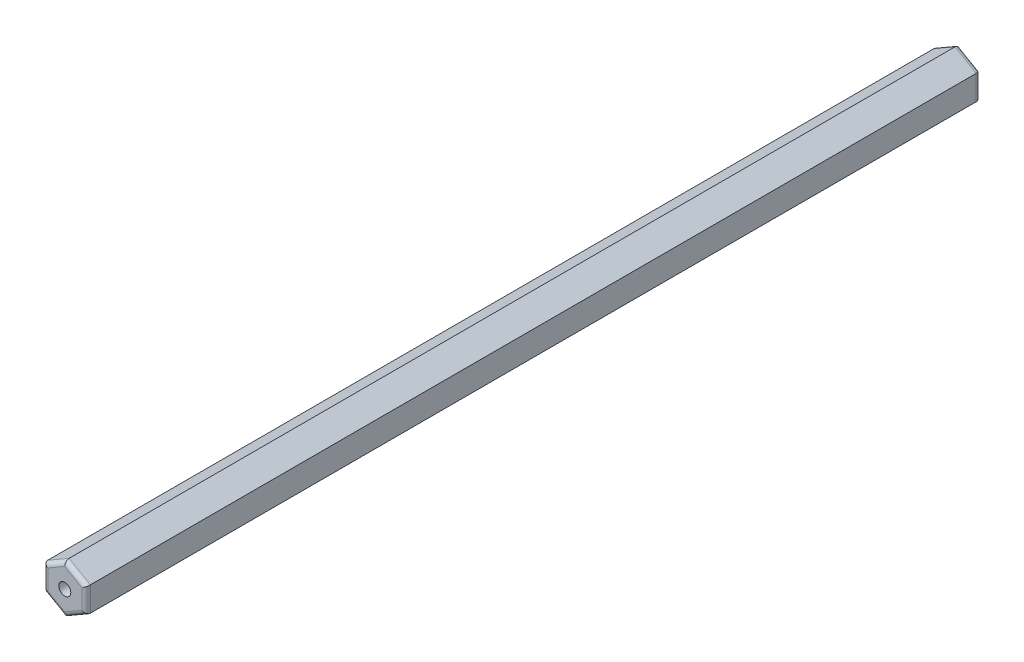
ISO-10303-21;
HEADER;
FILE_DESCRIPTION(('STEP AP214'),'2;1');
FILE_NAME('part.step','',(''),(''),'','','');
FILE_SCHEMA(('AUTOMOTIVE_DESIGN { 1 0 10303 214 1 1 1 1 }'));
ENDSEC;
DATA;
#1=APPLICATION_CONTEXT('core data for automotive mechanical design processes');
#2=APPLICATION_PROTOCOL_DEFINITION('international standard','automotive_design',2000,#1);
#3=PRODUCT_CONTEXT('',#1,'mechanical');
#4=PRODUCT('Part','Part','',(#3));
#5=PRODUCT_RELATED_PRODUCT_CATEGORY('part','',(#4));
#6=PRODUCT_DEFINITION_FORMATION('','',#4);
#7=PRODUCT_DEFINITION_CONTEXT('part definition',#1,'design');
#8=PRODUCT_DEFINITION('design','',#6,#7);
#9=PRODUCT_DEFINITION_SHAPE('','',#8);
#10=(LENGTH_UNIT() NAMED_UNIT(*) SI_UNIT(.MILLI.,.METRE.));
#11=(NAMED_UNIT(*) PLANE_ANGLE_UNIT() SI_UNIT($,.RADIAN.));
#12=(NAMED_UNIT(*) SI_UNIT($,.STERADIAN.) SOLID_ANGLE_UNIT());
#13=UNCERTAINTY_MEASURE_WITH_UNIT(LENGTH_MEASURE(1.E-05),#10,'distance_accuracy_value','');
#14=(GEOMETRIC_REPRESENTATION_CONTEXT(3) GLOBAL_UNCERTAINTY_ASSIGNED_CONTEXT((#13)) GLOBAL_UNIT_ASSIGNED_CONTEXT((#10,
#11,#12)) REPRESENTATION_CONTEXT('',''));
#15=CARTESIAN_POINT('',(0.,0.,0.));
#16=DIRECTION('',(0.,0.,1.));
#17=DIRECTION('',(1.,0.,0.));
#18=AXIS2_PLACEMENT_3D('',#15,#16,#17);
#19=CARTESIAN_POINT('',(-52.50212267549,1.44337567297407,30.));
#20=DIRECTION('',(0.5,0.866025403784439,0.));
#21=DIRECTION('',(-0.866025403784439,0.5,0.));
#22=AXIS2_PLACEMENT_3D('',#19,#20,#21);
#23=PLANE('',#22);
#24=DIRECTION('',(0.,0.,1.));
#25=VECTOR('',#24,1.);
#26=CARTESIAN_POINT('',(-55.00212267549,2.88675134594813,30.));
#27=LINE('',#26,#25);
#28=CARTESIAN_POINT('',(-55.00212267549,2.88675134594813,30.5));
#29=VERTEX_POINT('',#28);
#30=CARTESIAN_POINT('',(-55.00212267549,2.88675134594813,134.5));
#31=VERTEX_POINT('',#30);
#32=EDGE_CURVE('E152',#29,#31,#27,.T.);
#33=ORIENTED_EDGE('',*,*,#32,.T.);
#34=DIRECTION('',(-0.866025403784439,0.5,0.));
#35=VECTOR('',#34,1.);
#36=CARTESIAN_POINT('',(-52.50212267549,1.44337567297407,134.5));
#37=LINE('',#36,#35);
#38=CARTESIAN_POINT('',(-52.50212267549,1.44337567297407,134.5));
#39=VERTEX_POINT('',#38);
#40=EDGE_CURVE('E149',#31,#39,#37,.F.);
#41=ORIENTED_EDGE('',*,*,#40,.T.);
#42=DIRECTION('',(0.,0.,1.));
#43=VECTOR('',#42,1.);
#44=CARTESIAN_POINT('',(-52.50212267549,1.44337567297407,30.));
#45=LINE('',#44,#43);
#46=CARTESIAN_POINT('',(-52.50212267549,1.44337567297407,30.5));
#47=VERTEX_POINT('',#46);
#48=EDGE_CURVE('E146',#47,#39,#45,.T.);
#49=ORIENTED_EDGE('',*,*,#48,.F.);
#50=DIRECTION('',(-0.866025403784439,0.5,0.));
#51=VECTOR('',#50,1.);
#52=CARTESIAN_POINT('',(-55.00212267549,2.88675134594813,30.5));
#53=LINE('',#52,#51);
#54=EDGE_CURVE('E206',#47,#29,#53,.T.);
#55=ORIENTED_EDGE('',*,*,#54,.T.);
#56=EDGE_LOOP('',(#33,#41,#49,#55));
#57=FACE_BOUND('',#56,.T.);
#58=ADVANCED_FACE('F32',(#57),#23,.T.);
#59=CARTESIAN_POINT('',(-52.50212267549,-1.44337567297408,30.));
#60=DIRECTION('',(1.,0.,0.));
#61=DIRECTION('',(0.,0.,-1.));
#62=AXIS2_PLACEMENT_3D('',#59,#60,#61);
#63=PLANE('',#62);
#64=ORIENTED_EDGE('',*,*,#48,.T.);
#65=DIRECTION('',(0.,1.,0.));
#66=VECTOR('',#65,1.);
#67=CARTESIAN_POINT('',(-52.50212267549,-1.44337567297408,134.5));
#68=LINE('',#67,#66);
#69=CARTESIAN_POINT('',(-52.50212267549,-1.44337567297408,134.5));
#70=VERTEX_POINT('',#69);
#71=EDGE_CURVE('E191',#39,#70,#68,.F.);
#72=ORIENTED_EDGE('',*,*,#71,.T.);
#73=DIRECTION('',(0.,0.,1.));
#74=VECTOR('',#73,1.);
#75=CARTESIAN_POINT('',(-52.50212267549,-1.44337567297408,30.));
#76=LINE('',#75,#74);
#77=CARTESIAN_POINT('',(-52.50212267549,-1.44337567297408,30.5));
#78=VERTEX_POINT('',#77);
#79=EDGE_CURVE('E255',#78,#70,#76,.T.);
#80=ORIENTED_EDGE('',*,*,#79,.F.);
#81=DIRECTION('',(0.,1.,0.));
#82=VECTOR('',#81,1.);
#83=CARTESIAN_POINT('',(-52.50212267549,1.44337567297407,30.5));
#84=LINE('',#83,#82);
#85=EDGE_CURVE('E197',#78,#47,#84,.T.);
#86=ORIENTED_EDGE('',*,*,#85,.T.);
#87=EDGE_LOOP('',(#64,#72,#80,#86));
#88=FACE_BOUND('',#87,.T.);
#89=ADVANCED_FACE('F284',(#88),#63,.T.);
#90=CARTESIAN_POINT('',(-55.00212267549,-2.88675134594813,30.));
#91=DIRECTION('',(0.5,-0.866025403784439,0.));
#92=DIRECTION('',(0.866025403784439,0.5,0.));
#93=AXIS2_PLACEMENT_3D('',#90,#91,#92);
#94=PLANE('',#93);
#95=ORIENTED_EDGE('',*,*,#79,.T.);
#96=DIRECTION('',(0.866025403784439,0.5,0.));
#97=VECTOR('',#96,1.);
#98=CARTESIAN_POINT('',(-55.00212267549,-2.88675134594813,134.5));
#99=LINE('',#98,#97);
#100=CARTESIAN_POINT('',(-55.00212267549,-2.88675134594813,134.5));
#101=VERTEX_POINT('',#100);
#102=EDGE_CURVE('E231',#70,#101,#99,.F.);
#103=ORIENTED_EDGE('',*,*,#102,.T.);
#104=DIRECTION('',(0.,0.,1.));
#105=VECTOR('',#104,1.);
#106=CARTESIAN_POINT('',(-55.00212267549,-2.88675134594813,30.));
#107=LINE('',#106,#105);
#108=CARTESIAN_POINT('',(-55.00212267549,-2.88675134594813,30.5));
#109=VERTEX_POINT('',#108);
#110=EDGE_CURVE('E253',#109,#101,#107,.T.);
#111=ORIENTED_EDGE('',*,*,#110,.F.);
#112=DIRECTION('',(0.866025403784439,0.5,0.));
#113=VECTOR('',#112,1.);
#114=CARTESIAN_POINT('',(-52.50212267549,-1.44337567297408,30.5));
#115=LINE('',#114,#113);
#116=EDGE_CURVE('E234',#109,#78,#115,.T.);
#117=ORIENTED_EDGE('',*,*,#116,.T.);
#118=EDGE_LOOP('',(#95,#103,#111,#117));
#119=FACE_BOUND('',#118,.T.);
#120=ADVANCED_FACE('F290',(#119),#94,.T.);
#121=CARTESIAN_POINT('',(-57.50212267549,-1.44337567297406,30.));
#122=DIRECTION('',(-0.5,-0.866025403784438,0.));
#123=DIRECTION('',(0.866025403784438,-0.5,0.));
#124=AXIS2_PLACEMENT_3D('',#121,#122,#123);
#125=PLANE('',#124);
#126=ORIENTED_EDGE('',*,*,#110,.T.);
#127=DIRECTION('',(0.866025403784438,-0.5,0.));
#128=VECTOR('',#127,1.);
#129=CARTESIAN_POINT('',(-57.50212267549,-1.44337567297406,134.5));
#130=LINE('',#129,#128);
#131=CARTESIAN_POINT('',(-57.50212267549,-1.44337567297406,134.5));
#132=VERTEX_POINT('',#131);
#133=EDGE_CURVE('E201',#101,#132,#130,.F.);
#134=ORIENTED_EDGE('',*,*,#133,.T.);
#135=DIRECTION('',(0.,0.,1.));
#136=VECTOR('',#135,1.);
#137=CARTESIAN_POINT('',(-57.50212267549,-1.44337567297406,30.));
#138=LINE('',#137,#136);
#139=CARTESIAN_POINT('',(-57.50212267549,-1.44337567297406,30.5));
#140=VERTEX_POINT('',#139);
#141=EDGE_CURVE('E250',#140,#132,#138,.T.);
#142=ORIENTED_EDGE('',*,*,#141,.F.);
#143=DIRECTION('',(0.866025403784438,-0.5,0.));
#144=VECTOR('',#143,1.);
#145=CARTESIAN_POINT('',(-55.00212267549,-2.88675134594813,30.5));
#146=LINE('',#145,#144);
#147=EDGE_CURVE('E226',#140,#109,#146,.T.);
#148=ORIENTED_EDGE('',*,*,#147,.T.);
#149=EDGE_LOOP('',(#126,#134,#142,#148));
#150=FACE_BOUND('',#149,.T.);
#151=ADVANCED_FACE('F339',(#150),#125,.T.);
#152=CARTESIAN_POINT('',(-57.50212267549,1.44337567297406,30.));
#153=DIRECTION('',(-1.,0.,0.));
#154=DIRECTION('',(0.,0.,1.));
#155=AXIS2_PLACEMENT_3D('',#152,#153,#154);
#156=PLANE('',#155);
#157=ORIENTED_EDGE('',*,*,#141,.T.);
#158=DIRECTION('',(0.,-1.,0.));
#159=VECTOR('',#158,1.);
#160=CARTESIAN_POINT('',(-57.50212267549,1.44337567297406,134.5));
#161=LINE('',#160,#159);
#162=CARTESIAN_POINT('',(-57.50212267549,1.44337567297406,134.5));
#163=VERTEX_POINT('',#162);
#164=EDGE_CURVE('E199',#132,#163,#161,.F.);
#165=ORIENTED_EDGE('',*,*,#164,.T.);
#166=DIRECTION('',(0.,0.,1.));
#167=VECTOR('',#166,1.);
#168=CARTESIAN_POINT('',(-57.50212267549,1.44337567297406,30.));
#169=LINE('',#168,#167);
#170=CARTESIAN_POINT('',(-57.50212267549,1.44337567297406,30.5));
#171=VERTEX_POINT('',#170);
#172=EDGE_CURVE('E247',#171,#163,#169,.T.);
#173=ORIENTED_EDGE('',*,*,#172,.F.);
#174=DIRECTION('',(0.,-1.,0.));
#175=VECTOR('',#174,1.);
#176=CARTESIAN_POINT('',(-57.50212267549,-1.44337567297406,30.5));
#177=LINE('',#176,#175);
#178=EDGE_CURVE('E196',#171,#140,#177,.T.);
#179=ORIENTED_EDGE('',*,*,#178,.T.);
#180=EDGE_LOOP('',(#157,#165,#173,#179));
#181=FACE_BOUND('',#180,.T.);
#182=ADVANCED_FACE('F341',(#181),#156,.T.);
#183=CARTESIAN_POINT('',(-55.00212267549,2.88675134594813,30.));
#184=DIRECTION('',(-0.5,0.866025403784439,0.));
#185=DIRECTION('',(-0.866025403784439,-0.5,0.));
#186=AXIS2_PLACEMENT_3D('',#183,#184,#185);
#187=PLANE('',#186);
#188=ORIENTED_EDGE('',*,*,#172,.T.);
#189=DIRECTION('',(-0.866025403784439,-0.5,0.));
#190=VECTOR('',#189,1.);
#191=CARTESIAN_POINT('',(-55.00212267549,2.88675134594813,134.5));
#192=LINE('',#191,#190);
#193=EDGE_CURVE('E211',#163,#31,#192,.F.);
#194=ORIENTED_EDGE('',*,*,#193,.T.);
#195=ORIENTED_EDGE('',*,*,#32,.F.);
#196=DIRECTION('',(-0.866025403784439,-0.5,0.));
#197=VECTOR('',#196,1.);
#198=CARTESIAN_POINT('',(-57.50212267549,1.44337567297406,30.5));
#199=LINE('',#198,#197);
#200=EDGE_CURVE('E209',#29,#171,#199,.T.);
#201=ORIENTED_EDGE('',*,*,#200,.T.);
#202=EDGE_LOOP('',(#188,#194,#195,#201));
#203=FACE_BOUND('',#202,.T.);
#204=ADVANCED_FACE('F280',(#203),#187,.T.);
#205=CARTESIAN_POINT('',(0.,0.,30.));
#206=DIRECTION('',(0.,0.,1.));
#207=DIRECTION('',(1.,0.,0.));
#208=AXIS2_PLACEMENT_3D('',#205,#206,#207);
#209=PLANE('',#208);
#210=CARTESIAN_POINT('',(-55.00212267549,0.,30.));
#211=DIRECTION('',(0.,0.,1.));
#212=DIRECTION('',(1.,0.,0.));
#213=AXIS2_PLACEMENT_3D('',#210,#211,#212);
#214=CIRCLE('',#213,0.701481341004905);
#215=CARTESIAN_POINT('',(-54.3006413344851,0.,30.));
#216=VERTEX_POINT('',#215);
#217=EDGE_CURVE('E161',#216,#216,#214,.T.);
#218=ORIENTED_EDGE('',*,*,#217,.T.);
#219=EDGE_LOOP('',(#218));
#220=FACE_BOUND('',#219,.T.);
#221=DIRECTION('',(0.,1.,0.));
#222=VECTOR('',#221,1.);
#223=CARTESIAN_POINT('',(-53.00212267549,-1.44337567297408,30.));
#224=LINE('',#223,#222);
#225=CARTESIAN_POINT('',(-53.00212267549,1.15470053837925,30.));
#226=VERTEX_POINT('',#225);
#227=CARTESIAN_POINT('',(-53.00212267549,-1.15470053837926,30.));
#228=VERTEX_POINT('',#227);
#229=EDGE_CURVE('E56',#226,#228,#224,.F.);
#230=ORIENTED_EDGE('',*,*,#229,.T.);
#231=DIRECTION('',(0.866025403784439,0.5,0.));
#232=VECTOR('',#231,1.);
#233=CARTESIAN_POINT('',(-55.25212267549,-2.45373864405591,30.));
#234=LINE('',#233,#232);
#235=CARTESIAN_POINT('',(-55.00212267549,-2.30940107675851,30.));
#236=VERTEX_POINT('',#235);
#237=EDGE_CURVE('E11',#228,#236,#234,.F.);
#238=ORIENTED_EDGE('',*,*,#237,.T.);
#239=DIRECTION('',(0.866025403784438,-0.5,0.));
#240=VECTOR('',#239,1.);
#241=CARTESIAN_POINT('',(-57.25212267549,-1.01036297108184,30.));
#242=LINE('',#241,#240);
#243=CARTESIAN_POINT('',(-57.00212267549,-1.15470053837925,30.));
#244=VERTEX_POINT('',#243);
#245=EDGE_CURVE('E41',#236,#244,#242,.F.);
#246=ORIENTED_EDGE('',*,*,#245,.T.);
#247=DIRECTION('',(0.,-1.,0.));
#248=VECTOR('',#247,1.);
#249=CARTESIAN_POINT('',(-57.00212267549,1.44337567297406,30.));
#250=LINE('',#249,#248);
#251=CARTESIAN_POINT('',(-57.00212267549,1.15470053837925,30.));
#252=VERTEX_POINT('',#251);
#253=EDGE_CURVE('E217',#244,#252,#250,.F.);
#254=ORIENTED_EDGE('',*,*,#253,.T.);
#255=DIRECTION('',(-0.866025403784439,-0.5,0.));
#256=VECTOR('',#255,1.);
#257=CARTESIAN_POINT('',(-54.75212267549,2.45373864405591,30.));
#258=LINE('',#257,#256);
#259=CARTESIAN_POINT('',(-55.00212267549,2.3094010767585,30.));
#260=VERTEX_POINT('',#259);
#261=EDGE_CURVE('E213',#252,#260,#258,.F.);
#262=ORIENTED_EDGE('',*,*,#261,.T.);
#263=DIRECTION('',(-0.866025403784439,0.5,0.));
#264=VECTOR('',#263,1.);
#265=CARTESIAN_POINT('',(-52.75212267549,1.01036297108185,30.));
#266=LINE('',#265,#264);
#267=EDGE_CURVE('E215',#260,#226,#266,.F.);
#268=ORIENTED_EDGE('',*,*,#267,.T.);
#269=EDGE_LOOP('',(#230,#238,#246,#254,#262,#268));
#270=FACE_BOUND('',#269,.T.);
#271=ADVANCED_FACE('F219',(#220,#270),#209,.F.);
#272=CARTESIAN_POINT('',(0.,0.,135.));
#273=DIRECTION('',(0.,0.,1.));
#274=DIRECTION('',(1.,0.,0.));
#275=AXIS2_PLACEMENT_3D('',#272,#273,#274);
#276=PLANE('',#275);
#277=CARTESIAN_POINT('',(-55.00212267549,0.,135.));
#278=DIRECTION('',(0.,0.,1.));
#279=DIRECTION('',(1.,0.,0.));
#280=AXIS2_PLACEMENT_3D('',#277,#278,#279);
#281=CIRCLE('',#280,0.701481341004905);
#282=CARTESIAN_POINT('',(-54.3006413344851,0.,135.));
#283=VERTEX_POINT('',#282);
#284=EDGE_CURVE('E258',#283,#283,#281,.T.);
#285=ORIENTED_EDGE('',*,*,#284,.F.);
#286=EDGE_LOOP('',(#285));
#287=FACE_BOUND('',#286,.T.);
#288=DIRECTION('',(0.866025403784438,-0.5,0.));
#289=VECTOR('',#288,1.);
#290=CARTESIAN_POINT('',(-14.7505306688725,-25.5486685570901,135.));
#291=LINE('',#290,#289);
#292=CARTESIAN_POINT('',(-57.00212267549,-1.15470053837926,135.));
#293=VERTEX_POINT('',#292);
#294=CARTESIAN_POINT('',(-55.00212267549,-2.30940107675851,135.));
#295=VERTEX_POINT('',#294);
#296=EDGE_CURVE('E241',#293,#295,#291,.T.);
#297=ORIENTED_EDGE('',*,*,#296,.T.);
#298=DIRECTION('',(0.866025403784439,0.5,0.));
#299=VECTOR('',#298,1.);
#300=CARTESIAN_POINT('',(-12.7505306688725,22.0845669419523,135.));
#301=LINE('',#300,#299);
#302=CARTESIAN_POINT('',(-53.00212267549,-1.15470053837926,135.));
#303=VERTEX_POINT('',#302);
#304=EDGE_CURVE('E239',#295,#303,#301,.T.);
#305=ORIENTED_EDGE('',*,*,#304,.T.);
#306=DIRECTION('',(0.,1.,0.));
#307=VECTOR('',#306,1.);
#308=CARTESIAN_POINT('',(-53.00212267549,0.,135.));
#309=LINE('',#308,#307);
#310=CARTESIAN_POINT('',(-53.00212267549,1.15470053837925,135.));
#311=VERTEX_POINT('',#310);
#312=EDGE_CURVE('E130',#303,#311,#309,.T.);
#313=ORIENTED_EDGE('',*,*,#312,.T.);
#314=DIRECTION('',(-0.866025403784439,0.5,0.));
#315=VECTOR('',#314,1.);
#316=CARTESIAN_POINT('',(-12.7505306688725,-22.0845669419524,135.));
#317=LINE('',#316,#315);
#318=CARTESIAN_POINT('',(-55.00212267549,2.3094010767585,135.));
#319=VERTEX_POINT('',#318);
#320=EDGE_CURVE('E123',#311,#319,#317,.T.);
#321=ORIENTED_EDGE('',*,*,#320,.T.);
#322=DIRECTION('',(-0.866025403784439,-0.5,0.));
#323=VECTOR('',#322,1.);
#324=CARTESIAN_POINT('',(-14.7505306688725,25.5486685570901,135.));
#325=LINE('',#324,#323);
#326=CARTESIAN_POINT('',(-57.00212267549,1.15470053837924,135.));
#327=VERTEX_POINT('',#326);
#328=EDGE_CURVE('E126',#319,#327,#325,.T.);
#329=ORIENTED_EDGE('',*,*,#328,.T.);
#330=DIRECTION('',(0.,-1.,0.));
#331=VECTOR('',#330,1.);
#332=CARTESIAN_POINT('',(-57.00212267549,0.,135.));
#333=LINE('',#332,#331);
#334=EDGE_CURVE('E135',#327,#293,#333,.T.);
#335=ORIENTED_EDGE('',*,*,#334,.T.);
#336=EDGE_LOOP('',(#297,#305,#313,#321,#329,#335));
#337=FACE_BOUND('',#336,.T.);
#338=ADVANCED_FACE('F125',(#287,#337),#276,.T.);
#339=CARTESIAN_POINT('',(-14.7505306688725,25.5486685570901,134.5));
#340=DIRECTION('',(-0.866025403784439,-0.5,0.));
#341=DIRECTION('',(0.5,-0.866025403784439,0.));
#342=AXIS2_PLACEMENT_3D('',#339,#340,#341);
#343=CYLINDRICAL_SURFACE('',#342,0.5);
#344=CARTESIAN_POINT('',(-55.00212267549,2.3094010767585,134.5));
#345=DIRECTION('',(-1.,0.,0.));
#346=DIRECTION('',(0.,-1.,0.));
#347=AXIS2_PLACEMENT_3D('',#344,#345,#346);
#348=ELLIPSE('',#347,0.577350269189626,0.5);
#349=EDGE_CURVE('E141',#31,#319,#348,.F.);
#350=ORIENTED_EDGE('',*,*,#349,.F.);
#351=ORIENTED_EDGE('',*,*,#193,.F.);
#352=CARTESIAN_POINT('',(-57.00212267549,1.15470053837924,134.5));
#353=DIRECTION('',(-0.5,-0.866025403784439,0.));
#354=DIRECTION('',(-0.866025403784439,0.5,0.));
#355=AXIS2_PLACEMENT_3D('',#352,#353,#354);
#356=ELLIPSE('',#355,0.577350269189626,0.5);
#357=EDGE_CURVE('E144',#327,#163,#356,.T.);
#358=ORIENTED_EDGE('',*,*,#357,.F.);
#359=ORIENTED_EDGE('',*,*,#328,.F.);
#360=EDGE_LOOP('',(#350,#351,#358,#359));
#361=FACE_BOUND('',#360,.T.);
#362=ADVANCED_FACE('F139',(#361),#343,.T.);
#363=CARTESIAN_POINT('',(-57.00212267549,0.,134.5));
#364=DIRECTION('',(0.,-1.,0.));
#365=DIRECTION('',(0.,0.,-1.));
#366=AXIS2_PLACEMENT_3D('',#363,#364,#365);
#367=CYLINDRICAL_SURFACE('',#366,0.5);
#368=ORIENTED_EDGE('',*,*,#357,.T.);
#369=ORIENTED_EDGE('',*,*,#164,.F.);
#370=CARTESIAN_POINT('',(-57.00212267549,-1.15470053837925,134.5));
#371=DIRECTION('',(0.5,-0.866025403784439,0.));
#372=DIRECTION('',(-0.866025403784439,-0.5,0.));
#373=AXIS2_PLACEMENT_3D('',#370,#371,#372);
#374=ELLIPSE('',#373,0.577350269189626,0.5);
#375=EDGE_CURVE('E150',#293,#132,#374,.T.);
#376=ORIENTED_EDGE('',*,*,#375,.F.);
#377=ORIENTED_EDGE('',*,*,#334,.F.);
#378=EDGE_LOOP('',(#368,#369,#376,#377));
#379=FACE_BOUND('',#378,.T.);
#380=ADVANCED_FACE('F278',(#379),#367,.T.);
#381=CARTESIAN_POINT('',(-12.7505306688725,-22.0845669419524,134.5));
#382=DIRECTION('',(-0.866025403784439,0.5,0.));
#383=DIRECTION('',(-0.5,-0.866025403784439,0.));
#384=AXIS2_PLACEMENT_3D('',#381,#382,#383);
#385=CYLINDRICAL_SURFACE('',#384,0.5);
#386=ORIENTED_EDGE('',*,*,#349,.T.);
#387=ORIENTED_EDGE('',*,*,#320,.F.);
#388=CARTESIAN_POINT('',(-53.00212267549,1.15470053837925,134.5));
#389=DIRECTION('',(-0.5,0.866025403784439,0.));
#390=DIRECTION('',(-0.866025403784439,-0.5,0.));
#391=AXIS2_PLACEMENT_3D('',#388,#389,#390);
#392=ELLIPSE('',#391,0.577350269189626,0.5);
#393=EDGE_CURVE('E155',#39,#311,#392,.F.);
#394=ORIENTED_EDGE('',*,*,#393,.F.);
#395=ORIENTED_EDGE('',*,*,#40,.F.);
#396=EDGE_LOOP('',(#386,#387,#394,#395));
#397=FACE_BOUND('',#396,.T.);
#398=ADVANCED_FACE('F148',(#397),#385,.T.);
#399=CARTESIAN_POINT('',(-14.7505306688725,-25.5486685570901,134.5));
#400=DIRECTION('',(0.866025403784438,-0.5,0.));
#401=DIRECTION('',(0.5,0.866025403784438,0.));
#402=AXIS2_PLACEMENT_3D('',#399,#400,#401);
#403=CYLINDRICAL_SURFACE('',#402,0.5);
#404=ORIENTED_EDGE('',*,*,#375,.T.);
#405=ORIENTED_EDGE('',*,*,#133,.F.);
#406=CARTESIAN_POINT('',(-55.00212267549,-2.30940107675851,134.5));
#407=DIRECTION('',(1.,0.,0.));
#408=DIRECTION('',(0.,-1.,0.));
#409=AXIS2_PLACEMENT_3D('',#406,#407,#408);
#410=ELLIPSE('',#409,0.577350269189626,0.5);
#411=EDGE_CURVE('E180',#295,#101,#410,.T.);
#412=ORIENTED_EDGE('',*,*,#411,.F.);
#413=ORIENTED_EDGE('',*,*,#296,.F.);
#414=EDGE_LOOP('',(#404,#405,#412,#413));
#415=FACE_BOUND('',#414,.T.);
#416=ADVANCED_FACE('F299',(#415),#403,.T.);
#417=CARTESIAN_POINT('',(-53.00212267549,0.,134.5));
#418=DIRECTION('',(0.,1.,0.));
#419=DIRECTION('',(0.,0.,1.));
#420=AXIS2_PLACEMENT_3D('',#417,#418,#419);
#421=CYLINDRICAL_SURFACE('',#420,0.5);
#422=ORIENTED_EDGE('',*,*,#393,.T.);
#423=ORIENTED_EDGE('',*,*,#312,.F.);
#424=CARTESIAN_POINT('',(-53.00212267549,-1.15470053837927,134.5));
#425=DIRECTION('',(0.5,0.866025403784438,0.));
#426=DIRECTION('',(-0.866025403784439,0.5,0.));
#427=AXIS2_PLACEMENT_3D('',#424,#425,#426);
#428=ELLIPSE('',#427,0.577350269189626,0.5);
#429=EDGE_CURVE('E175',#70,#303,#428,.F.);
#430=ORIENTED_EDGE('',*,*,#429,.F.);
#431=ORIENTED_EDGE('',*,*,#71,.F.);
#432=EDGE_LOOP('',(#422,#423,#430,#431));
#433=FACE_BOUND('',#432,.T.);
#434=ADVANCED_FACE('F190',(#433),#421,.T.);
#435=CARTESIAN_POINT('',(-12.7505306688725,22.0845669419523,134.5));
#436=DIRECTION('',(0.866025403784439,0.5,0.));
#437=DIRECTION('',(-0.5,0.866025403784439,0.));
#438=AXIS2_PLACEMENT_3D('',#435,#436,#437);
#439=CYLINDRICAL_SURFACE('',#438,0.5);
#440=ORIENTED_EDGE('',*,*,#411,.T.);
#441=ORIENTED_EDGE('',*,*,#102,.F.);
#442=ORIENTED_EDGE('',*,*,#429,.T.);
#443=ORIENTED_EDGE('',*,*,#304,.F.);
#444=EDGE_LOOP('',(#440,#441,#442,#443));
#445=FACE_BOUND('',#444,.T.);
#446=ADVANCED_FACE('F294',(#445),#439,.T.);
#447=CARTESIAN_POINT('',(-54.75212267549,2.45373864405591,30.5));
#448=DIRECTION('',(0.866025403784439,0.5,0.));
#449=DIRECTION('',(-0.5,0.866025403784439,0.));
#450=AXIS2_PLACEMENT_3D('',#447,#448,#449);
#451=CYLINDRICAL_SURFACE('',#450,0.5);
#452=CARTESIAN_POINT('',(-55.00212267549,2.3094010767585,30.5));
#453=DIRECTION('',(1.,0.,0.));
#454=DIRECTION('',(0.,1.,0.));
#455=AXIS2_PLACEMENT_3D('',#452,#453,#454);
#456=ELLIPSE('',#455,0.577350269189626,0.5);
#457=EDGE_CURVE('E168',#260,#29,#456,.T.);
#458=ORIENTED_EDGE('',*,*,#457,.F.);
#459=ORIENTED_EDGE('',*,*,#261,.F.);
#460=CARTESIAN_POINT('',(-57.00212267549,1.15470053837925,30.5));
#461=DIRECTION('',(0.5,0.866025403784439,0.));
#462=DIRECTION('',(0.866025403784439,-0.5,0.));
#463=AXIS2_PLACEMENT_3D('',#460,#461,#462);
#464=ELLIPSE('',#463,0.577350269189626,0.5);
#465=EDGE_CURVE('E36',#171,#252,#464,.F.);
#466=ORIENTED_EDGE('',*,*,#465,.F.);
#467=ORIENTED_EDGE('',*,*,#200,.F.);
#468=EDGE_LOOP('',(#458,#459,#466,#467));
#469=FACE_BOUND('',#468,.T.);
#470=ADVANCED_FACE('F34',(#469),#451,.T.);
#471=CARTESIAN_POINT('',(-57.00212267549,1.44337567297406,30.5));
#472=DIRECTION('',(0.,1.,0.));
#473=DIRECTION('',(0.,0.,1.));
#474=AXIS2_PLACEMENT_3D('',#471,#472,#473);
#475=CYLINDRICAL_SURFACE('',#474,0.5);
#476=ORIENTED_EDGE('',*,*,#465,.T.);
#477=ORIENTED_EDGE('',*,*,#253,.F.);
#478=CARTESIAN_POINT('',(-57.00212267549,-1.15470053837925,30.5));
#479=DIRECTION('',(-0.5,0.866025403784439,0.));
#480=DIRECTION('',(0.866025403784439,0.5,0.));
#481=AXIS2_PLACEMENT_3D('',#478,#479,#480);
#482=ELLIPSE('',#481,0.577350269189626,0.5);
#483=EDGE_CURVE('E166',#140,#244,#482,.F.);
#484=ORIENTED_EDGE('',*,*,#483,.F.);
#485=ORIENTED_EDGE('',*,*,#178,.F.);
#486=EDGE_LOOP('',(#476,#477,#484,#485));
#487=FACE_BOUND('',#486,.T.);
#488=ADVANCED_FACE('F223',(#487),#475,.T.);
#489=CARTESIAN_POINT('',(-52.75212267549,1.01036297108185,30.5));
#490=DIRECTION('',(0.866025403784439,-0.5,0.));
#491=DIRECTION('',(0.5,0.866025403784439,0.));
#492=AXIS2_PLACEMENT_3D('',#489,#490,#491);
#493=CYLINDRICAL_SURFACE('',#492,0.5);
#494=ORIENTED_EDGE('',*,*,#457,.T.);
#495=ORIENTED_EDGE('',*,*,#54,.F.);
#496=CARTESIAN_POINT('',(-53.00212267549,1.15470053837925,30.5));
#497=DIRECTION('',(0.5,-0.866025403784439,0.));
#498=DIRECTION('',(0.866025403784439,0.5,0.));
#499=AXIS2_PLACEMENT_3D('',#496,#497,#498);
#500=ELLIPSE('',#499,0.577350269189626,0.5);
#501=EDGE_CURVE('E163',#226,#47,#500,.T.);
#502=ORIENTED_EDGE('',*,*,#501,.F.);
#503=ORIENTED_EDGE('',*,*,#267,.F.);
#504=EDGE_LOOP('',(#494,#495,#502,#503));
#505=FACE_BOUND('',#504,.T.);
#506=ADVANCED_FACE('F316',(#505),#493,.T.);
#507=CARTESIAN_POINT('',(-57.25212267549,-1.01036297108184,30.5));
#508=DIRECTION('',(-0.866025403784438,0.5,0.));
#509=DIRECTION('',(-0.5,-0.866025403784438,0.));
#510=AXIS2_PLACEMENT_3D('',#507,#508,#509);
#511=CYLINDRICAL_SURFACE('',#510,0.5);
#512=ORIENTED_EDGE('',*,*,#483,.T.);
#513=ORIENTED_EDGE('',*,*,#245,.F.);
#514=CARTESIAN_POINT('',(-55.00212267549,-2.30940107675851,30.5));
#515=DIRECTION('',(-1.,0.,0.));
#516=DIRECTION('',(0.,1.,0.));
#517=AXIS2_PLACEMENT_3D('',#514,#515,#516);
#518=ELLIPSE('',#517,0.577350269189626,0.5);
#519=EDGE_CURVE('E49',#109,#236,#518,.F.);
#520=ORIENTED_EDGE('',*,*,#519,.F.);
#521=ORIENTED_EDGE('',*,*,#147,.F.);
#522=EDGE_LOOP('',(#512,#513,#520,#521));
#523=FACE_BOUND('',#522,.T.);
#524=ADVANCED_FACE('F225',(#523),#511,.T.);
#525=CARTESIAN_POINT('',(-53.00212267549,-1.44337567297408,30.5));
#526=DIRECTION('',(0.,-1.,0.));
#527=DIRECTION('',(0.,0.,-1.));
#528=AXIS2_PLACEMENT_3D('',#525,#526,#527);
#529=CYLINDRICAL_SURFACE('',#528,0.5);
#530=ORIENTED_EDGE('',*,*,#501,.T.);
#531=ORIENTED_EDGE('',*,*,#85,.F.);
#532=CARTESIAN_POINT('',(-53.00212267549,-1.15470053837926,30.5));
#533=DIRECTION('',(-0.5,-0.866025403784438,0.));
#534=DIRECTION('',(0.866025403784439,-0.5,0.));
#535=AXIS2_PLACEMENT_3D('',#532,#533,#534);
#536=ELLIPSE('',#535,0.577350269189626,0.5);
#537=EDGE_CURVE('E159',#228,#78,#536,.T.);
#538=ORIENTED_EDGE('',*,*,#537,.F.);
#539=ORIENTED_EDGE('',*,*,#229,.F.);
#540=EDGE_LOOP('',(#530,#531,#538,#539));
#541=FACE_BOUND('',#540,.T.);
#542=ADVANCED_FACE('F310',(#541),#529,.T.);
#543=CARTESIAN_POINT('',(-55.25212267549,-2.45373864405591,30.5));
#544=DIRECTION('',(-0.866025403784439,-0.5,0.));
#545=DIRECTION('',(0.5,-0.866025403784439,0.));
#546=AXIS2_PLACEMENT_3D('',#543,#544,#545);
#547=CYLINDRICAL_SURFACE('',#546,0.5);
#548=ORIENTED_EDGE('',*,*,#519,.T.);
#549=ORIENTED_EDGE('',*,*,#237,.F.);
#550=ORIENTED_EDGE('',*,*,#537,.T.);
#551=ORIENTED_EDGE('',*,*,#116,.F.);
#552=EDGE_LOOP('',(#548,#549,#550,#551));
#553=FACE_BOUND('',#552,.T.);
#554=ADVANCED_FACE('F268',(#553),#547,.T.);
#555=CARTESIAN_POINT('',(-55.00212267549,0.,30.));
#556=DIRECTION('',(0.,0.,1.));
#557=DIRECTION('',(1.,0.,0.));
#558=AXIS2_PLACEMENT_3D('',#555,#556,#557);
#559=CYLINDRICAL_SURFACE('',#558,0.701481341004905);
#560=ORIENTED_EDGE('',*,*,#217,.F.);
#561=EDGE_LOOP('',(#560));
#562=FACE_BOUND('',#561,.T.);
#563=ORIENTED_EDGE('',*,*,#284,.T.);
#564=EDGE_LOOP('',(#563));
#565=FACE_BOUND('',#564,.T.);
#566=ADVANCED_FACE('F265',(#562,#565),#559,.F.);
#567=CLOSED_SHELL('',(#58,#89,#120,#151,#182,#204,#271,#338,#362,#380,#398,#416,#434,#446,#470,
#488,#506,#524,#542,#554,#566));
#568=MANIFOLD_SOLID_BREP('B2',#567);
#569=ADVANCED_BREP_SHAPE_REPRESENTATION('',(#18,#568),#14);
#570=SHAPE_DEFINITION_REPRESENTATION(#9,#569);
ENDSEC;
END-ISO-10303-21;
